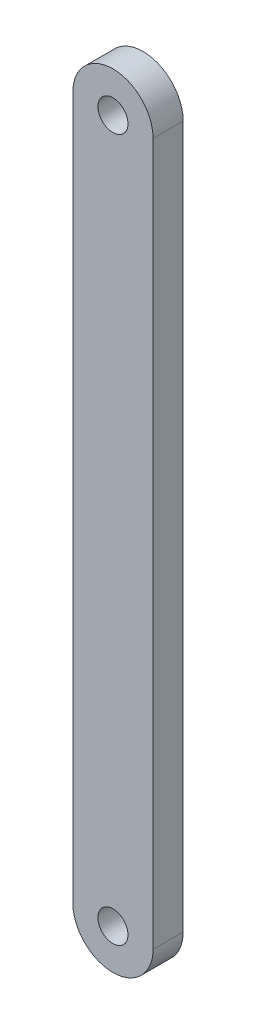
ISO-10303-21;
HEADER;
FILE_DESCRIPTION(('STEP AP214'),'2;1');
FILE_NAME('part.step','',(''),(''),'','','');
FILE_SCHEMA(('AUTOMOTIVE_DESIGN { 1 0 10303 214 1 1 1 1 }'));
ENDSEC;
DATA;
#1=APPLICATION_CONTEXT('core data for automotive mechanical design processes');
#2=APPLICATION_PROTOCOL_DEFINITION('international standard','automotive_design',2000,#1);
#3=PRODUCT_CONTEXT('',#1,'mechanical');
#4=PRODUCT('Part','Part','',(#3));
#5=PRODUCT_RELATED_PRODUCT_CATEGORY('part','',(#4));
#6=PRODUCT_DEFINITION_FORMATION('','',#4);
#7=PRODUCT_DEFINITION_CONTEXT('part definition',#1,'design');
#8=PRODUCT_DEFINITION('design','',#6,#7);
#9=PRODUCT_DEFINITION_SHAPE('','',#8);
#10=(LENGTH_UNIT() NAMED_UNIT(*) SI_UNIT(.MILLI.,.METRE.));
#11=(NAMED_UNIT(*) PLANE_ANGLE_UNIT() SI_UNIT($,.RADIAN.));
#12=(NAMED_UNIT(*) SI_UNIT($,.STERADIAN.) SOLID_ANGLE_UNIT());
#13=UNCERTAINTY_MEASURE_WITH_UNIT(LENGTH_MEASURE(1.E-05),#10,'distance_accuracy_value','');
#14=(GEOMETRIC_REPRESENTATION_CONTEXT(3) GLOBAL_UNCERTAINTY_ASSIGNED_CONTEXT((#13)) GLOBAL_UNIT_ASSIGNED_CONTEXT((#10,
#11,#12)) REPRESENTATION_CONTEXT('',''));
#15=CARTESIAN_POINT('',(0.,0.,0.));
#16=DIRECTION('',(0.,0.,1.));
#17=DIRECTION('',(1.,0.,0.));
#18=AXIS2_PLACEMENT_3D('',#15,#16,#17);
#19=CARTESIAN_POINT('',(3.99999999999999,35.,3.));
#20=DIRECTION('',(-1.,0.,0.));
#21=DIRECTION('',(0.,-1.,0.));
#22=AXIS2_PLACEMENT_3D('',#19,#20,#21);
#23=PLANE('',#22);
#24=DIRECTION('',(0.,1.,0.));
#25=VECTOR('',#24,1.);
#26=CARTESIAN_POINT('',(3.99999999999999,35.,0.));
#27=LINE('',#26,#25);
#28=CARTESIAN_POINT('',(4.,-35.,0.));
#29=VERTEX_POINT('',#28);
#30=CARTESIAN_POINT('',(4.,35.,0.));
#31=VERTEX_POINT('',#30);
#32=EDGE_CURVE('E76',#29,#31,#27,.T.);
#33=ORIENTED_EDGE('',*,*,#32,.T.);
#34=DIRECTION('',(0.,0.,-1.));
#35=VECTOR('',#34,1.);
#36=CARTESIAN_POINT('',(3.99999999999999,35.,3.));
#37=LINE('',#36,#35);
#38=CARTESIAN_POINT('',(4.,35.,3.));
#39=VERTEX_POINT('',#38);
#40=EDGE_CURVE('E11',#39,#31,#37,.T.);
#41=ORIENTED_EDGE('',*,*,#40,.F.);
#42=DIRECTION('',(0.,1.,0.));
#43=VECTOR('',#42,1.);
#44=CARTESIAN_POINT('',(3.99999999999999,35.,3.));
#45=LINE('',#44,#43);
#46=CARTESIAN_POINT('',(4.,-35.,3.));
#47=VERTEX_POINT('',#46);
#48=EDGE_CURVE('E51',#47,#39,#45,.T.);
#49=ORIENTED_EDGE('',*,*,#48,.F.);
#50=DIRECTION('',(0.,0.,-1.));
#51=VECTOR('',#50,1.);
#52=CARTESIAN_POINT('',(4.,-35.,3.));
#53=LINE('',#52,#51);
#54=EDGE_CURVE('E84',#47,#29,#53,.T.);
#55=ORIENTED_EDGE('',*,*,#54,.T.);
#56=EDGE_LOOP('',(#33,#41,#49,#55));
#57=FACE_BOUND('',#56,.T.);
#58=ADVANCED_FACE('F35',(#57),#23,.F.);
#59=CARTESIAN_POINT('',(-4.00000000000001,35.,3.));
#60=DIRECTION('',(1.,0.,0.));
#61=DIRECTION('',(0.,1.,0.));
#62=AXIS2_PLACEMENT_3D('',#59,#60,#61);
#63=PLANE('',#62);
#64=DIRECTION('',(0.,-1.,0.));
#65=VECTOR('',#64,1.);
#66=CARTESIAN_POINT('',(-4.00000000000001,35.,0.));
#67=LINE('',#66,#65);
#68=CARTESIAN_POINT('',(-4.00000000000001,35.,0.));
#69=VERTEX_POINT('',#68);
#70=CARTESIAN_POINT('',(-4.,-35.,0.));
#71=VERTEX_POINT('',#70);
#72=EDGE_CURVE('E81',#69,#71,#67,.T.);
#73=ORIENTED_EDGE('',*,*,#72,.T.);
#74=DIRECTION('',(0.,0.,-1.));
#75=VECTOR('',#74,1.);
#76=CARTESIAN_POINT('',(-4.,-35.,3.));
#77=LINE('',#76,#75);
#78=CARTESIAN_POINT('',(-4.,-35.,3.));
#79=VERTEX_POINT('',#78);
#80=EDGE_CURVE('E88',#79,#71,#77,.T.);
#81=ORIENTED_EDGE('',*,*,#80,.F.);
#82=DIRECTION('',(0.,-1.,0.));
#83=VECTOR('',#82,1.);
#84=CARTESIAN_POINT('',(-4.00000000000001,35.,3.));
#85=LINE('',#84,#83);
#86=CARTESIAN_POINT('',(-4.,35.,3.));
#87=VERTEX_POINT('',#86);
#88=EDGE_CURVE('E89',#87,#79,#85,.T.);
#89=ORIENTED_EDGE('',*,*,#88,.F.);
#90=DIRECTION('',(0.,0.,-1.));
#91=VECTOR('',#90,1.);
#92=CARTESIAN_POINT('',(-4.00000000000001,35.,3.));
#93=LINE('',#92,#91);
#94=EDGE_CURVE('E43',#87,#69,#93,.T.);
#95=ORIENTED_EDGE('',*,*,#94,.T.);
#96=EDGE_LOOP('',(#73,#81,#89,#95));
#97=FACE_BOUND('',#96,.T.);
#98=ADVANCED_FACE('F111',(#97),#63,.F.);
#99=CARTESIAN_POINT('',(0.,0.,3.));
#100=DIRECTION('',(0.,0.,1.));
#101=DIRECTION('',(1.,0.,0.));
#102=AXIS2_PLACEMENT_3D('',#99,#100,#101);
#103=PLANE('',#102);
#104=CARTESIAN_POINT('',(0.,35.,3.));
#105=DIRECTION('',(0.,0.,1.));
#106=DIRECTION('',(1.,0.,0.));
#107=AXIS2_PLACEMENT_3D('',#104,#105,#106);
#108=CIRCLE('',#107,1.5);
#109=CARTESIAN_POINT('',(1.5,35.,3.));
#110=VERTEX_POINT('',#109);
#111=EDGE_CURVE('E99',#110,#110,#108,.T.);
#112=ORIENTED_EDGE('',*,*,#111,.F.);
#113=EDGE_LOOP('',(#112));
#114=FACE_BOUND('',#113,.T.);
#115=CARTESIAN_POINT('',(0.,-35.,3.));
#116=DIRECTION('',(0.,0.,1.));
#117=DIRECTION('',(1.,0.,0.));
#118=AXIS2_PLACEMENT_3D('',#115,#116,#117);
#119=CIRCLE('',#118,1.5);
#120=CARTESIAN_POINT('',(1.5,-35.,3.));
#121=VERTEX_POINT('',#120);
#122=EDGE_CURVE('E192',#121,#121,#119,.T.);
#123=ORIENTED_EDGE('',*,*,#122,.F.);
#124=EDGE_LOOP('',(#123));
#125=FACE_BOUND('',#124,.T.);
#126=ORIENTED_EDGE('',*,*,#88,.T.);
#127=CARTESIAN_POINT('',(0.,-35.,3.));
#128=DIRECTION('',(0.,0.,1.));
#129=DIRECTION('',(1.,0.,0.));
#130=AXIS2_PLACEMENT_3D('',#127,#128,#129);
#131=CIRCLE('',#130,4.);
#132=EDGE_CURVE('E94',#79,#47,#131,.T.);
#133=ORIENTED_EDGE('',*,*,#132,.T.);
#134=ORIENTED_EDGE('',*,*,#48,.T.);
#135=CARTESIAN_POINT('',(0.,35.,3.));
#136=DIRECTION('',(0.,0.,1.));
#137=DIRECTION('',(1.,0.,0.));
#138=AXIS2_PLACEMENT_3D('',#135,#136,#137);
#139=CIRCLE('',#138,4.);
#140=EDGE_CURVE('E82',#39,#87,#139,.T.);
#141=ORIENTED_EDGE('',*,*,#140,.T.);
#142=EDGE_LOOP('',(#126,#133,#134,#141));
#143=FACE_BOUND('',#142,.T.);
#144=ADVANCED_FACE('F114',(#114,#125,#143),#103,.T.);
#145=CARTESIAN_POINT('',(0.,0.,0.));
#146=DIRECTION('',(0.,0.,1.));
#147=DIRECTION('',(1.,0.,0.));
#148=AXIS2_PLACEMENT_3D('',#145,#146,#147);
#149=PLANE('',#148);
#150=CARTESIAN_POINT('',(0.,35.,0.));
#151=DIRECTION('',(0.,0.,1.));
#152=DIRECTION('',(1.,0.,0.));
#153=AXIS2_PLACEMENT_3D('',#150,#151,#152);
#154=CIRCLE('',#153,1.5);
#155=CARTESIAN_POINT('',(1.5,35.,0.));
#156=VERTEX_POINT('',#155);
#157=EDGE_CURVE('E95',#156,#156,#154,.T.);
#158=ORIENTED_EDGE('',*,*,#157,.T.);
#159=EDGE_LOOP('',(#158));
#160=FACE_BOUND('',#159,.T.);
#161=CARTESIAN_POINT('',(0.,-35.,0.));
#162=DIRECTION('',(0.,0.,1.));
#163=DIRECTION('',(1.,0.,0.));
#164=AXIS2_PLACEMENT_3D('',#161,#162,#163);
#165=CIRCLE('',#164,1.5);
#166=CARTESIAN_POINT('',(1.5,-35.,0.));
#167=VERTEX_POINT('',#166);
#168=EDGE_CURVE('E189',#167,#167,#165,.T.);
#169=ORIENTED_EDGE('',*,*,#168,.T.);
#170=EDGE_LOOP('',(#169));
#171=FACE_BOUND('',#170,.T.);
#172=ORIENTED_EDGE('',*,*,#32,.F.);
#173=CARTESIAN_POINT('',(0.,-35.,0.));
#174=DIRECTION('',(0.,0.,1.));
#175=DIRECTION('',(1.,0.,0.));
#176=AXIS2_PLACEMENT_3D('',#173,#174,#175);
#177=CIRCLE('',#176,4.);
#178=EDGE_CURVE('E80',#71,#29,#177,.T.);
#179=ORIENTED_EDGE('',*,*,#178,.F.);
#180=ORIENTED_EDGE('',*,*,#72,.F.);
#181=CARTESIAN_POINT('',(0.,35.,0.));
#182=DIRECTION('',(0.,0.,1.));
#183=DIRECTION('',(1.,0.,0.));
#184=AXIS2_PLACEMENT_3D('',#181,#182,#183);
#185=CIRCLE('',#184,4.);
#186=EDGE_CURVE('E62',#31,#69,#185,.T.);
#187=ORIENTED_EDGE('',*,*,#186,.F.);
#188=EDGE_LOOP('',(#172,#179,#180,#187));
#189=FACE_BOUND('',#188,.T.);
#190=ADVANCED_FACE('F77',(#160,#171,#189),#149,.F.);
#191=CARTESIAN_POINT('',(0.,35.,3.));
#192=DIRECTION('',(0.,0.,-1.));
#193=DIRECTION('',(-1.,0.,0.));
#194=AXIS2_PLACEMENT_3D('',#191,#192,#193);
#195=CYLINDRICAL_SURFACE('',#194,4.);
#196=ORIENTED_EDGE('',*,*,#140,.F.);
#197=ORIENTED_EDGE('',*,*,#40,.T.);
#198=ORIENTED_EDGE('',*,*,#186,.T.);
#199=ORIENTED_EDGE('',*,*,#94,.F.);
#200=EDGE_LOOP('',(#196,#197,#198,#199));
#201=FACE_BOUND('',#200,.T.);
#202=ADVANCED_FACE('F112',(#201),#195,.T.);
#203=CARTESIAN_POINT('',(0.,-35.,3.));
#204=DIRECTION('',(0.,0.,-1.));
#205=DIRECTION('',(-1.,0.,0.));
#206=AXIS2_PLACEMENT_3D('',#203,#204,#205);
#207=CYLINDRICAL_SURFACE('',#206,4.);
#208=ORIENTED_EDGE('',*,*,#178,.T.);
#209=ORIENTED_EDGE('',*,*,#54,.F.);
#210=ORIENTED_EDGE('',*,*,#132,.F.);
#211=ORIENTED_EDGE('',*,*,#80,.T.);
#212=EDGE_LOOP('',(#208,#209,#210,#211));
#213=FACE_BOUND('',#212,.T.);
#214=ADVANCED_FACE('F92',(#213),#207,.T.);
#215=CARTESIAN_POINT('',(0.,-35.,0.));
#216=DIRECTION('',(0.,0.,1.));
#217=DIRECTION('',(1.,0.,0.));
#218=AXIS2_PLACEMENT_3D('',#215,#216,#217);
#219=CYLINDRICAL_SURFACE('',#218,1.5);
#220=ORIENTED_EDGE('',*,*,#168,.F.);
#221=EDGE_LOOP('',(#220));
#222=FACE_BOUND('',#221,.T.);
#223=ORIENTED_EDGE('',*,*,#122,.T.);
#224=EDGE_LOOP('',(#223));
#225=FACE_BOUND('',#224,.T.);
#226=ADVANCED_FACE('F151',(#222,#225),#219,.F.);
#227=CARTESIAN_POINT('',(0.,35.,0.));
#228=DIRECTION('',(0.,0.,1.));
#229=DIRECTION('',(1.,0.,0.));
#230=AXIS2_PLACEMENT_3D('',#227,#228,#229);
#231=CYLINDRICAL_SURFACE('',#230,1.5);
#232=ORIENTED_EDGE('',*,*,#157,.F.);
#233=EDGE_LOOP('',(#232));
#234=FACE_BOUND('',#233,.T.);
#235=ORIENTED_EDGE('',*,*,#111,.T.);
#236=EDGE_LOOP('',(#235));
#237=FACE_BOUND('',#236,.T.);
#238=ADVANCED_FACE('F172',(#234,#237),#231,.F.);
#239=CLOSED_SHELL('',(#58,#98,#144,#190,#202,#214,#226,#238));
#240=MANIFOLD_SOLID_BREP('B2',#239);
#241=ADVANCED_BREP_SHAPE_REPRESENTATION('',(#18,#240),#14);
#242=SHAPE_DEFINITION_REPRESENTATION(#9,#241);
ENDSEC;
END-ISO-10303-21;
